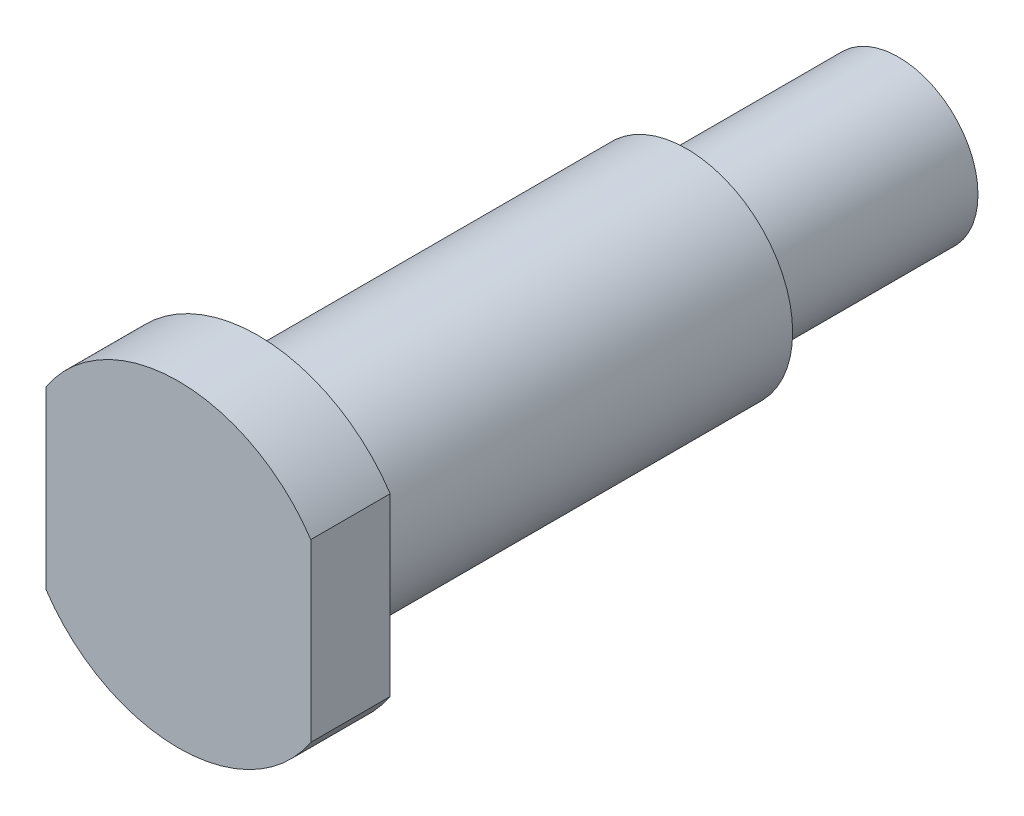
ISO-10303-21;
HEADER;
FILE_DESCRIPTION(('STEP AP214'),'2;1');
FILE_NAME('part.step','',(''),(''),'','','');
FILE_SCHEMA(('AUTOMOTIVE_DESIGN { 1 0 10303 214 1 1 1 1 }'));
ENDSEC;
DATA;
#1=APPLICATION_CONTEXT('core data for automotive mechanical design processes');
#2=APPLICATION_PROTOCOL_DEFINITION('international standard','automotive_design',2000,#1);
#3=PRODUCT_CONTEXT('',#1,'mechanical');
#4=PRODUCT('Part','Part','',(#3));
#5=PRODUCT_RELATED_PRODUCT_CATEGORY('part','',(#4));
#6=PRODUCT_DEFINITION_FORMATION('','',#4);
#7=PRODUCT_DEFINITION_CONTEXT('part definition',#1,'design');
#8=PRODUCT_DEFINITION('design','',#6,#7);
#9=PRODUCT_DEFINITION_SHAPE('','',#8);
#10=(LENGTH_UNIT() NAMED_UNIT(*) SI_UNIT(.MILLI.,.METRE.));
#11=(NAMED_UNIT(*) PLANE_ANGLE_UNIT() SI_UNIT($,.RADIAN.));
#12=(NAMED_UNIT(*) SI_UNIT($,.STERADIAN.) SOLID_ANGLE_UNIT());
#13=UNCERTAINTY_MEASURE_WITH_UNIT(LENGTH_MEASURE(1.E-05),#10,'distance_accuracy_value','');
#14=(GEOMETRIC_REPRESENTATION_CONTEXT(3) GLOBAL_UNCERTAINTY_ASSIGNED_CONTEXT((#13)) GLOBAL_UNIT_ASSIGNED_CONTEXT((#10,
#11,#12)) REPRESENTATION_CONTEXT('',''));
#15=CARTESIAN_POINT('',(0.,0.,0.));
#16=DIRECTION('',(0.,0.,1.));
#17=DIRECTION('',(1.,0.,0.));
#18=AXIS2_PLACEMENT_3D('',#15,#16,#17);
#19=CARTESIAN_POINT('',(0.,0.,0.));
#20=DIRECTION('',(0.,0.,-1.));
#21=DIRECTION('',(-1.,0.,0.));
#22=AXIS2_PLACEMENT_3D('',#19,#20,#21);
#23=PLANE('',#22);
#24=DIRECTION('',(0.,-1.,0.));
#25=VECTOR('',#24,1.);
#26=CARTESIAN_POINT('',(-5.,6.53973580077437,0.));
#27=LINE('',#26,#25);
#28=CARTESIAN_POINT('',(-5.,3.3166247903554,0.));
#29=VERTEX_POINT('',#28);
#30=CARTESIAN_POINT('',(-5.,-3.3166247903554,0.));
#31=VERTEX_POINT('',#30);
#32=EDGE_CURVE('E82',#29,#31,#27,.T.);
#33=ORIENTED_EDGE('',*,*,#32,.T.);
#34=CARTESIAN_POINT('',(0.,0.,0.));
#35=DIRECTION('',(0.,0.,1.));
#36=DIRECTION('',(1.,0.,0.));
#37=AXIS2_PLACEMENT_3D('',#34,#35,#36);
#38=CIRCLE('',#37,6.);
#39=CARTESIAN_POINT('',(5.,-3.3166247903554,0.));
#40=VERTEX_POINT('',#39);
#41=EDGE_CURVE('E89',#31,#40,#38,.T.);
#42=ORIENTED_EDGE('',*,*,#41,.T.);
#43=DIRECTION('',(0.,1.,0.));
#44=VECTOR('',#43,1.);
#45=CARTESIAN_POINT('',(5.,6.53973580077437,0.));
#46=LINE('',#45,#44);
#47=CARTESIAN_POINT('',(5.,3.3166247903554,0.));
#48=VERTEX_POINT('',#47);
#49=EDGE_CURVE('E74',#40,#48,#46,.T.);
#50=ORIENTED_EDGE('',*,*,#49,.T.);
#51=EDGE_CURVE('E94',#48,#29,#38,.T.);
#52=ORIENTED_EDGE('',*,*,#51,.T.);
#53=EDGE_LOOP('',(#33,#42,#50,#52));
#54=FACE_BOUND('',#53,.T.);
#55=ADVANCED_FACE('F37',(#54),#23,.F.);
#56=CARTESIAN_POINT('',(0.,0.,0.));
#57=DIRECTION('',(0.,0.,1.));
#58=DIRECTION('',(1.,0.,0.));
#59=AXIS2_PLACEMENT_3D('',#56,#57,#58);
#60=CYLINDRICAL_SURFACE('',#59,6.);
#61=DIRECTION('',(0.,0.,1.));
#62=VECTOR('',#61,1.);
#63=CARTESIAN_POINT('',(-5.,-3.3166247903554,0.));
#64=LINE('',#63,#62);
#65=CARTESIAN_POINT('',(-5.,-3.3166247903554,-3.));
#66=VERTEX_POINT('',#65);
#67=EDGE_CURVE('E107',#66,#31,#64,.T.);
#68=ORIENTED_EDGE('',*,*,#67,.F.);
#69=CARTESIAN_POINT('',(0.,0.,-3.));
#70=DIRECTION('',(0.,0.,1.));
#71=DIRECTION('',(1.,0.,0.));
#72=AXIS2_PLACEMENT_3D('',#69,#70,#71);
#73=CIRCLE('',#72,6.);
#74=CARTESIAN_POINT('',(5.,-3.3166247903554,-3.));
#75=VERTEX_POINT('',#74);
#76=EDGE_CURVE('E91',#66,#75,#73,.T.);
#77=ORIENTED_EDGE('',*,*,#76,.T.);
#78=DIRECTION('',(0.,0.,1.));
#79=VECTOR('',#78,1.);
#80=CARTESIAN_POINT('',(5.,-3.3166247903554,0.));
#81=LINE('',#80,#79);
#82=EDGE_CURVE('E51',#40,#75,#81,.F.);
#83=ORIENTED_EDGE('',*,*,#82,.F.);
#84=ORIENTED_EDGE('',*,*,#41,.F.);
#85=EDGE_LOOP('',(#68,#77,#83,#84));
#86=FACE_BOUND('',#85,.T.);
#87=ADVANCED_FACE('F88',(#86),#60,.T.);
#88=DIRECTION('',(0.,0.,1.));
#89=VECTOR('',#88,1.);
#90=CARTESIAN_POINT('',(-5.,3.3166247903554,0.));
#91=LINE('',#90,#89);
#92=CARTESIAN_POINT('',(-5.,3.3166247903554,-3.));
#93=VERTEX_POINT('',#92);
#94=EDGE_CURVE('E58',#29,#93,#91,.F.);
#95=ORIENTED_EDGE('',*,*,#94,.F.);
#96=ORIENTED_EDGE('',*,*,#51,.F.);
#97=DIRECTION('',(0.,0.,1.));
#98=VECTOR('',#97,1.);
#99=CARTESIAN_POINT('',(5.,3.3166247903554,0.));
#100=LINE('',#99,#98);
#101=CARTESIAN_POINT('',(5.,3.3166247903554,-3.));
#102=VERTEX_POINT('',#101);
#103=EDGE_CURVE('E77',#102,#48,#100,.T.);
#104=ORIENTED_EDGE('',*,*,#103,.F.);
#105=EDGE_CURVE('E95',#102,#93,#73,.T.);
#106=ORIENTED_EDGE('',*,*,#105,.T.);
#107=EDGE_LOOP('',(#95,#96,#104,#106));
#108=FACE_BOUND('',#107,.T.);
#109=ADVANCED_FACE('F103',(#108),#60,.T.);
#110=CARTESIAN_POINT('',(0.,6.,-3.));
#111=DIRECTION('',(0.,0.,1.));
#112=DIRECTION('',(1.,0.,0.));
#113=AXIS2_PLACEMENT_3D('',#110,#111,#112);
#114=PLANE('',#113);
#115=CARTESIAN_POINT('',(0.,0.,-3.));
#116=DIRECTION('',(0.,0.,1.));
#117=DIRECTION('',(1.,0.,0.));
#118=AXIS2_PLACEMENT_3D('',#115,#116,#117);
#119=CIRCLE('',#118,4.);
#120=CARTESIAN_POINT('',(4.,0.,-3.));
#121=VERTEX_POINT('',#120);
#122=EDGE_CURVE('E119',#121,#121,#119,.T.);
#123=ORIENTED_EDGE('',*,*,#122,.T.);
#124=EDGE_LOOP('',(#123));
#125=FACE_BOUND('',#124,.T.);
#126=DIRECTION('',(0.,-1.,0.));
#127=VECTOR('',#126,1.);
#128=CARTESIAN_POINT('',(-5.,6.,-3.));
#129=LINE('',#128,#127);
#130=EDGE_CURVE('E12',#93,#66,#129,.T.);
#131=ORIENTED_EDGE('',*,*,#130,.F.);
#132=ORIENTED_EDGE('',*,*,#105,.F.);
#133=DIRECTION('',(0.,1.,0.));
#134=VECTOR('',#133,1.);
#135=CARTESIAN_POINT('',(5.,6.,-3.));
#136=LINE('',#135,#134);
#137=EDGE_CURVE('E44',#75,#102,#136,.T.);
#138=ORIENTED_EDGE('',*,*,#137,.F.);
#139=ORIENTED_EDGE('',*,*,#76,.F.);
#140=EDGE_LOOP('',(#131,#132,#138,#139));
#141=FACE_BOUND('',#140,.T.);
#142=ADVANCED_FACE('F105',(#125,#141),#114,.F.);
#143=CARTESIAN_POINT('',(0.,0.,0.));
#144=DIRECTION('',(0.,0.,1.));
#145=DIRECTION('',(1.,0.,0.));
#146=AXIS2_PLACEMENT_3D('',#143,#144,#145);
#147=CYLINDRICAL_SURFACE('',#146,4.);
#148=ORIENTED_EDGE('',*,*,#122,.F.);
#149=EDGE_LOOP('',(#148));
#150=FACE_BOUND('',#149,.T.);
#151=CARTESIAN_POINT('',(0.,0.,-19.2));
#152=DIRECTION('',(0.,0.,1.));
#153=DIRECTION('',(1.,0.,0.));
#154=AXIS2_PLACEMENT_3D('',#151,#152,#153);
#155=CIRCLE('',#154,4.);
#156=CARTESIAN_POINT('',(4.,0.,-19.2));
#157=VERTEX_POINT('',#156);
#158=EDGE_CURVE('E117',#157,#157,#155,.T.);
#159=ORIENTED_EDGE('',*,*,#158,.T.);
#160=EDGE_LOOP('',(#159));
#161=FACE_BOUND('',#160,.T.);
#162=ADVANCED_FACE('F124',(#150,#161),#147,.T.);
#163=CARTESIAN_POINT('',(0.,4.,-19.2));
#164=DIRECTION('',(0.,0.,1.));
#165=DIRECTION('',(1.,0.,0.));
#166=AXIS2_PLACEMENT_3D('',#163,#164,#165);
#167=PLANE('',#166);
#168=ORIENTED_EDGE('',*,*,#158,.F.);
#169=EDGE_LOOP('',(#168));
#170=FACE_BOUND('',#169,.T.);
#171=CARTESIAN_POINT('',(0.,0.,-19.2));
#172=DIRECTION('',(0.,0.,1.));
#173=DIRECTION('',(1.,0.,0.));
#174=AXIS2_PLACEMENT_3D('',#171,#172,#173);
#175=CIRCLE('',#174,3.);
#176=CARTESIAN_POINT('',(3.,0.,-19.2));
#177=VERTEX_POINT('',#176);
#178=EDGE_CURVE('E111',#177,#177,#175,.T.);
#179=ORIENTED_EDGE('',*,*,#178,.T.);
#180=EDGE_LOOP('',(#179));
#181=FACE_BOUND('',#180,.T.);
#182=ADVANCED_FACE('F127',(#170,#181),#167,.F.);
#183=CARTESIAN_POINT('',(0.,0.,0.));
#184=DIRECTION('',(0.,0.,1.));
#185=DIRECTION('',(1.,0.,0.));
#186=AXIS2_PLACEMENT_3D('',#183,#184,#185);
#187=CYLINDRICAL_SURFACE('',#186,3.);
#188=ORIENTED_EDGE('',*,*,#178,.F.);
#189=EDGE_LOOP('',(#188));
#190=FACE_BOUND('',#189,.T.);
#191=CARTESIAN_POINT('',(0.,0.,-27.2));
#192=DIRECTION('',(0.,0.,1.));
#193=DIRECTION('',(1.,0.,0.));
#194=AXIS2_PLACEMENT_3D('',#191,#192,#193);
#195=CIRCLE('',#194,3.);
#196=CARTESIAN_POINT('',(3.,0.,-27.2));
#197=VERTEX_POINT('',#196);
#198=EDGE_CURVE('E108',#197,#197,#195,.T.);
#199=ORIENTED_EDGE('',*,*,#198,.T.);
#200=EDGE_LOOP('',(#199));
#201=FACE_BOUND('',#200,.T.);
#202=ADVANCED_FACE('F133',(#190,#201),#187,.T.);
#203=CARTESIAN_POINT('',(0.,3.,-27.2));
#204=DIRECTION('',(0.,0.,1.));
#205=DIRECTION('',(1.,0.,0.));
#206=AXIS2_PLACEMENT_3D('',#203,#204,#205);
#207=PLANE('',#206);
#208=ORIENTED_EDGE('',*,*,#198,.F.);
#209=EDGE_LOOP('',(#208));
#210=FACE_BOUND('',#209,.T.);
#211=ADVANCED_FACE('F139',(#210),#207,.F.);
#212=CARTESIAN_POINT('',(5.,6.53973580077437,-10.));
#213=DIRECTION('',(1.,0.,0.));
#214=DIRECTION('',(0.,1.,0.));
#215=AXIS2_PLACEMENT_3D('',#212,#213,#214);
#216=PLANE('',#215);
#217=ORIENTED_EDGE('',*,*,#103,.T.);
#218=ORIENTED_EDGE('',*,*,#49,.F.);
#219=ORIENTED_EDGE('',*,*,#82,.T.);
#220=ORIENTED_EDGE('',*,*,#137,.T.);
#221=EDGE_LOOP('',(#217,#218,#219,#220));
#222=FACE_BOUND('',#221,.T.);
#223=ADVANCED_FACE('F75',(#222),#216,.T.);
#224=CARTESIAN_POINT('',(-5.,6.53973580077437,-10.));
#225=DIRECTION('',(-1.,0.,0.));
#226=DIRECTION('',(0.,-1.,0.));
#227=AXIS2_PLACEMENT_3D('',#224,#225,#226);
#228=PLANE('',#227);
#229=ORIENTED_EDGE('',*,*,#67,.T.);
#230=ORIENTED_EDGE('',*,*,#32,.F.);
#231=ORIENTED_EDGE('',*,*,#94,.T.);
#232=ORIENTED_EDGE('',*,*,#130,.T.);
#233=EDGE_LOOP('',(#229,#230,#231,#232));
#234=FACE_BOUND('',#233,.T.);
#235=ADVANCED_FACE('F106',(#234),#228,.T.);
#236=CLOSED_SHELL('',(#55,#87,#109,#142,#162,#182,#202,#211,#223,#235));
#237=MANIFOLD_SOLID_BREP('B2',#236);
#238=ADVANCED_BREP_SHAPE_REPRESENTATION('',(#18,#237),#14);
#239=SHAPE_DEFINITION_REPRESENTATION(#9,#238);
ENDSEC;
END-ISO-10303-21;
